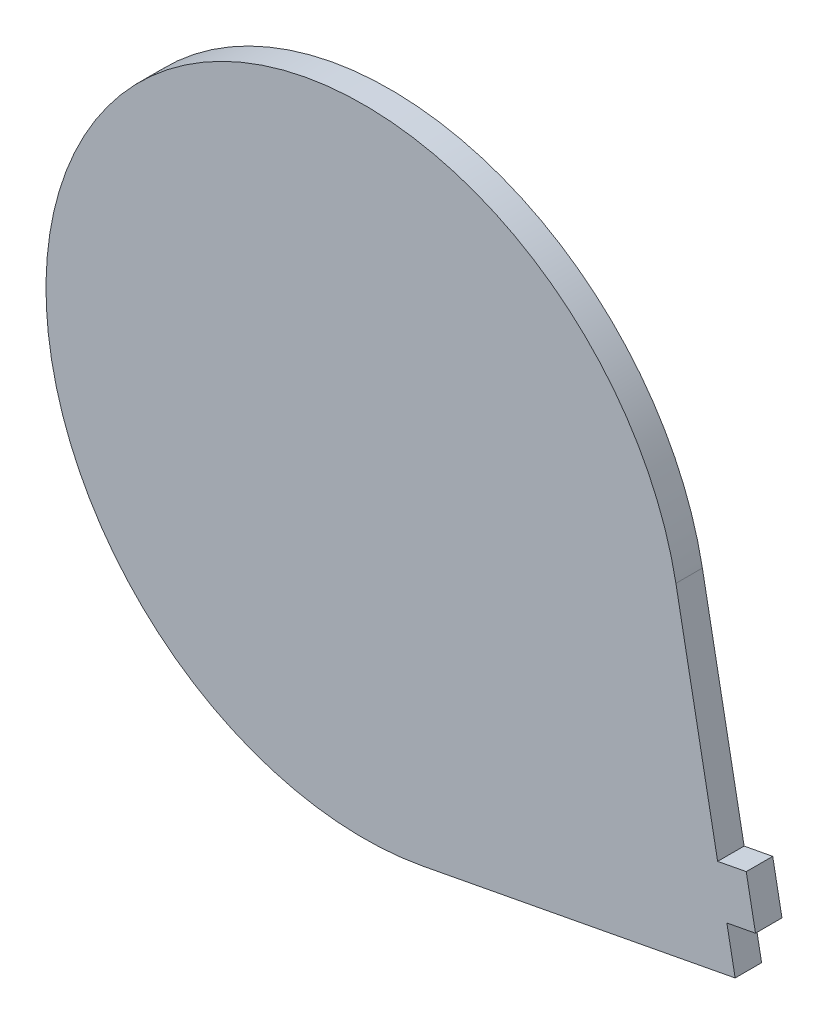
ISO-10303-21;
HEADER;
FILE_DESCRIPTION(('STEP AP214'),'2;1');
FILE_NAME('part.step','',(''),(''),'','','');
FILE_SCHEMA(('AUTOMOTIVE_DESIGN { 1 0 10303 214 1 1 1 1 }'));
ENDSEC;
DATA;
#1=APPLICATION_CONTEXT('core data for automotive mechanical design processes');
#2=APPLICATION_PROTOCOL_DEFINITION('international standard','automotive_design',2000,#1);
#3=PRODUCT_CONTEXT('',#1,'mechanical');
#4=PRODUCT('Part','Part','',(#3));
#5=PRODUCT_RELATED_PRODUCT_CATEGORY('part','',(#4));
#6=PRODUCT_DEFINITION_FORMATION('','',#4);
#7=PRODUCT_DEFINITION_CONTEXT('part definition',#1,'design');
#8=PRODUCT_DEFINITION('design','',#6,#7);
#9=PRODUCT_DEFINITION_SHAPE('','',#8);
#10=(LENGTH_UNIT() NAMED_UNIT(*) SI_UNIT(.MILLI.,.METRE.));
#11=(NAMED_UNIT(*) PLANE_ANGLE_UNIT() SI_UNIT($,.RADIAN.));
#12=(NAMED_UNIT(*) SI_UNIT($,.STERADIAN.) SOLID_ANGLE_UNIT());
#13=UNCERTAINTY_MEASURE_WITH_UNIT(LENGTH_MEASURE(1.E-05),#10,'distance_accuracy_value','');
#14=(GEOMETRIC_REPRESENTATION_CONTEXT(3) GLOBAL_UNCERTAINTY_ASSIGNED_CONTEXT((#13)) GLOBAL_UNIT_ASSIGNED_CONTEXT((#10,
#11,#12)) REPRESENTATION_CONTEXT('',''));
#15=CARTESIAN_POINT('',(0.,0.,0.));
#16=DIRECTION('',(0.,0.,1.));
#17=DIRECTION('',(1.,0.,0.));
#18=AXIS2_PLACEMENT_3D('',#15,#16,#17);
#19=CARTESIAN_POINT('',(73.9776567042315,-38.5157686824239,5.));
#20=DIRECTION('',(-0.186433879772931,0.98246751013599,0.));
#21=DIRECTION('',(-0.98246751013599,-0.186433879772931,0.));
#22=AXIS2_PLACEMENT_3D('',#19,#20,#21);
#23=PLANE('',#22);
#24=DIRECTION('',(0.98246751013599,0.186433879772931,0.));
#25=VECTOR('',#24,1.);
#26=CARTESIAN_POINT('',(73.9776567042315,-38.5157686824239,0.));
#27=LINE('',#26,#25);
#28=CARTESIAN_POINT('',(68.5740853984835,-39.5411550211751,0.));
#29=VERTEX_POINT('',#28);
#30=CARTESIAN_POINT('',(73.9776567042315,-38.5157686824239,0.));
#31=VERTEX_POINT('',#30);
#32=EDGE_CURVE('E123',#29,#31,#27,.T.);
#33=ORIENTED_EDGE('',*,*,#32,.T.);
#34=DIRECTION('',(0.,0.,-1.));
#35=VECTOR('',#34,1.);
#36=CARTESIAN_POINT('',(73.9776567042315,-38.5157686824239,5.));
#37=LINE('',#36,#35);
#38=CARTESIAN_POINT('',(73.9776567042315,-38.5157686824239,5.));
#39=VERTEX_POINT('',#38);
#40=EDGE_CURVE('E11',#39,#31,#37,.T.);
#41=ORIENTED_EDGE('',*,*,#40,.F.);
#42=DIRECTION('',(0.98246751013599,0.186433879772931,0.));
#43=VECTOR('',#42,1.);
#44=CARTESIAN_POINT('',(73.9776567042315,-38.5157686824239,5.));
#45=LINE('',#44,#43);
#46=CARTESIAN_POINT('',(68.5740853984835,-39.5411550211751,5.));
#47=VERTEX_POINT('',#46);
#48=EDGE_CURVE('E135',#47,#39,#45,.T.);
#49=ORIENTED_EDGE('',*,*,#48,.F.);
#50=DIRECTION('',(0.,0.,-1.));
#51=VECTOR('',#50,1.);
#52=CARTESIAN_POINT('',(68.5740853984835,-39.5411550211751,5.));
#53=LINE('',#52,#51);
#54=EDGE_CURVE('E119',#47,#29,#53,.T.);
#55=ORIENTED_EDGE('',*,*,#54,.T.);
#56=EDGE_LOOP('',(#33,#41,#49,#55));
#57=FACE_BOUND('',#56,.T.);
#58=ADVANCED_FACE('F33',(#57),#23,.F.);
#59=CARTESIAN_POINT('',(73.9776567042315,-38.5157686824239,5.));
#60=DIRECTION('',(-0.982467510135989,-0.186433879772938,0.));
#61=DIRECTION('',(0.186433879772938,-0.982467510135989,0.));
#62=AXIS2_PLACEMENT_3D('',#59,#60,#61);
#63=PLANE('',#62);
#64=DIRECTION('',(-0.186433879772938,0.982467510135989,0.));
#65=VECTOR('',#64,1.);
#66=CARTESIAN_POINT('',(73.9776567042315,-38.5157686824239,0.));
#67=LINE('',#66,#65);
#68=CARTESIAN_POINT('',(72.231899428722,-29.315993374092,0.));
#69=VERTEX_POINT('',#68);
#70=EDGE_CURVE('E126',#31,#69,#67,.T.);
#71=ORIENTED_EDGE('',*,*,#70,.T.);
#72=DIRECTION('',(0.,0.,-1.));
#73=VECTOR('',#72,1.);
#74=CARTESIAN_POINT('',(72.231899428722,-29.315993374092,5.));
#75=LINE('',#74,#73);
#76=CARTESIAN_POINT('',(72.231899428722,-29.315993374092,5.));
#77=VERTEX_POINT('',#76);
#78=EDGE_CURVE('E41',#77,#69,#75,.T.);
#79=ORIENTED_EDGE('',*,*,#78,.F.);
#80=DIRECTION('',(-0.186433879772938,0.982467510135989,0.));
#81=VECTOR('',#80,1.);
#82=CARTESIAN_POINT('',(73.9776567042315,-38.5157686824239,5.));
#83=LINE('',#82,#81);
#84=EDGE_CURVE('E89',#39,#77,#83,.T.);
#85=ORIENTED_EDGE('',*,*,#84,.F.);
#86=ORIENTED_EDGE('',*,*,#40,.T.);
#87=EDGE_LOOP('',(#71,#79,#85,#86));
#88=FACE_BOUND('',#87,.T.);
#89=ADVANCED_FACE('F160',(#88),#63,.F.);
#90=CARTESIAN_POINT('',(66.828328122974,-30.3413797128432,5.));
#91=DIRECTION('',(0.186433879772939,-0.982467510135989,0.));
#92=DIRECTION('',(0.982467510135989,0.186433879772939,0.));
#93=AXIS2_PLACEMENT_3D('',#90,#91,#92);
#94=PLANE('',#93);
#95=DIRECTION('',(-0.982467510135989,-0.186433879772939,0.));
#96=VECTOR('',#95,1.);
#97=CARTESIAN_POINT('',(66.828328122974,-30.3413797128432,0.));
#98=LINE('',#97,#96);
#99=CARTESIAN_POINT('',(66.828328122974,-30.3413797128432,0.));
#100=VERTEX_POINT('',#99);
#101=EDGE_CURVE('E128',#69,#100,#98,.T.);
#102=ORIENTED_EDGE('',*,*,#101,.T.);
#103=DIRECTION('',(0.,0.,-1.));
#104=VECTOR('',#103,1.);
#105=CARTESIAN_POINT('',(66.828328122974,-30.3413797128432,5.));
#106=LINE('',#105,#104);
#107=CARTESIAN_POINT('',(66.828328122974,-30.3413797128432,5.));
#108=VERTEX_POINT('',#107);
#109=EDGE_CURVE('E139',#108,#100,#106,.T.);
#110=ORIENTED_EDGE('',*,*,#109,.F.);
#111=DIRECTION('',(-0.982467510135989,-0.186433879772939,0.));
#112=VECTOR('',#111,1.);
#113=CARTESIAN_POINT('',(66.828328122974,-30.3413797128432,5.));
#114=LINE('',#113,#112);
#115=EDGE_CURVE('E147',#77,#108,#114,.T.);
#116=ORIENTED_EDGE('',*,*,#115,.F.);
#117=ORIENTED_EDGE('',*,*,#78,.T.);
#118=EDGE_LOOP('',(#102,#110,#116,#117));
#119=FACE_BOUND('',#118,.T.);
#120=ADVANCED_FACE('F145',(#119),#94,.F.);
#121=CARTESIAN_POINT('',(58.9480506081592,11.1860327863763,5.));
#122=DIRECTION('',(-0.982467510135989,-0.186433879772939,0.));
#123=DIRECTION('',(0.186433879772939,-0.982467510135989,0.));
#124=AXIS2_PLACEMENT_3D('',#121,#122,#123);
#125=PLANE('',#124);
#126=DIRECTION('',(-0.186433879772939,0.982467510135989,0.));
#127=VECTOR('',#126,1.);
#128=CARTESIAN_POINT('',(58.9480506081592,11.1860327863763,0.));
#129=LINE('',#128,#127);
#130=CARTESIAN_POINT('',(58.9480506081592,11.1860327863763,0.));
#131=VERTEX_POINT('',#130);
#132=EDGE_CURVE('E130',#100,#131,#129,.T.);
#133=ORIENTED_EDGE('',*,*,#132,.T.);
#134=DIRECTION('',(0.,0.,-1.));
#135=VECTOR('',#134,1.);
#136=CARTESIAN_POINT('',(58.9480506081592,11.1860327863763,5.));
#137=LINE('',#136,#135);
#138=CARTESIAN_POINT('',(58.9480506081592,11.1860327863763,5.));
#139=VERTEX_POINT('',#138);
#140=EDGE_CURVE('E114',#139,#131,#137,.T.);
#141=ORIENTED_EDGE('',*,*,#140,.F.);
#142=DIRECTION('',(-0.186433879772939,0.982467510135989,0.));
#143=VECTOR('',#142,1.);
#144=CARTESIAN_POINT('',(58.9480506081592,11.1860327863763,5.));
#145=LINE('',#144,#143);
#146=EDGE_CURVE('E105',#108,#139,#145,.T.);
#147=ORIENTED_EDGE('',*,*,#146,.F.);
#148=ORIENTED_EDGE('',*,*,#109,.T.);
#149=EDGE_LOOP('',(#133,#141,#147,#148));
#150=FACE_BOUND('',#149,.T.);
#151=ADVANCED_FACE('F153',(#150),#125,.F.);
#152=CARTESIAN_POINT('',(0.,0.,5.));
#153=DIRECTION('',(0.,0.,-1.));
#154=DIRECTION('',(-1.,0.,0.));
#155=AXIS2_PLACEMENT_3D('',#152,#153,#154);
#156=CYLINDRICAL_SURFACE('',#155,60.);
#157=CARTESIAN_POINT('',(0.,0.,0.));
#158=DIRECTION('',(0.,0.,1.));
#159=DIRECTION('',(1.,0.,0.));
#160=AXIS2_PLACEMENT_3D('',#157,#158,#159);
#161=CIRCLE('',#160,60.);
#162=CARTESIAN_POINT('',(11.1860327863762,-58.9480506081593,0.));
#163=VERTEX_POINT('',#162);
#164=EDGE_CURVE('E113',#131,#163,#161,.T.);
#165=ORIENTED_EDGE('',*,*,#164,.T.);
#166=DIRECTION('',(0.,0.,-1.));
#167=VECTOR('',#166,1.);
#168=CARTESIAN_POINT('',(11.1860327863762,-58.9480506081593,5.));
#169=LINE('',#168,#167);
#170=CARTESIAN_POINT('',(11.1860327863762,-58.9480506081593,5.));
#171=VERTEX_POINT('',#170);
#172=EDGE_CURVE('E110',#171,#163,#169,.T.);
#173=ORIENTED_EDGE('',*,*,#172,.F.);
#174=CARTESIAN_POINT('',(0.,0.,5.));
#175=DIRECTION('',(0.,0.,1.));
#176=DIRECTION('',(1.,0.,0.));
#177=AXIS2_PLACEMENT_3D('',#174,#175,#176);
#178=CIRCLE('',#177,60.);
#179=EDGE_CURVE('E99',#139,#171,#178,.T.);
#180=ORIENTED_EDGE('',*,*,#179,.F.);
#181=ORIENTED_EDGE('',*,*,#140,.T.);
#182=EDGE_LOOP('',(#165,#173,#180,#181));
#183=FACE_BOUND('',#182,.T.);
#184=ADVANCED_FACE('F111',(#183),#156,.T.);
#185=CARTESIAN_POINT('',(70.1340833945355,-47.762017821783,5.));
#186=DIRECTION('',(-0.186433879772941,0.982467510135989,0.));
#187=DIRECTION('',(-0.982467510135989,-0.186433879772941,0.));
#188=AXIS2_PLACEMENT_3D('',#185,#186,#187);
#189=PLANE('',#188);
#190=DIRECTION('',(0.982467510135988,0.186433879772941,0.));
#191=VECTOR('',#190,1.);
#192=CARTESIAN_POINT('',(70.1340833945355,-47.762017821783,0.));
#193=LINE('',#192,#191);
#194=CARTESIAN_POINT('',(70.1340833945355,-47.762017821783,0.));
#195=VERTEX_POINT('',#194);
#196=EDGE_CURVE('E75',#163,#195,#193,.T.);
#197=ORIENTED_EDGE('',*,*,#196,.T.);
#198=DIRECTION('',(0.,0.,-1.));
#199=VECTOR('',#198,1.);
#200=CARTESIAN_POINT('',(70.1340833945355,-47.762017821783,5.));
#201=LINE('',#200,#199);
#202=CARTESIAN_POINT('',(70.1340833945355,-47.762017821783,5.));
#203=VERTEX_POINT('',#202);
#204=EDGE_CURVE('E115',#203,#195,#201,.T.);
#205=ORIENTED_EDGE('',*,*,#204,.F.);
#206=DIRECTION('',(0.982467510135988,0.186433879772941,0.));
#207=VECTOR('',#206,1.);
#208=CARTESIAN_POINT('',(70.1340833945355,-47.762017821783,5.));
#209=LINE('',#208,#207);
#210=EDGE_CURVE('E103',#171,#203,#209,.T.);
#211=ORIENTED_EDGE('',*,*,#210,.F.);
#212=ORIENTED_EDGE('',*,*,#172,.T.);
#213=EDGE_LOOP('',(#197,#205,#211,#212));
#214=FACE_BOUND('',#213,.T.);
#215=ADVANCED_FACE('F117',(#214),#189,.F.);
#216=CARTESIAN_POINT('',(68.5740853984835,-39.5411550211751,5.));
#217=DIRECTION('',(-0.982467510135989,-0.186433879772938,0.));
#218=DIRECTION('',(0.186433879772938,-0.982467510135989,0.));
#219=AXIS2_PLACEMENT_3D('',#216,#217,#218);
#220=PLANE('',#219);
#221=DIRECTION('',(-0.186433879772938,0.982467510135989,0.));
#222=VECTOR('',#221,1.);
#223=CARTESIAN_POINT('',(68.5740853984835,-39.5411550211751,0.));
#224=LINE('',#223,#222);
#225=EDGE_CURVE('E81',#195,#29,#224,.T.);
#226=ORIENTED_EDGE('',*,*,#225,.T.);
#227=ORIENTED_EDGE('',*,*,#54,.F.);
#228=DIRECTION('',(-0.186433879772938,0.982467510135989,0.));
#229=VECTOR('',#228,1.);
#230=CARTESIAN_POINT('',(68.5740853984835,-39.5411550211751,5.));
#231=LINE('',#230,#229);
#232=EDGE_CURVE('E49',#203,#47,#231,.T.);
#233=ORIENTED_EDGE('',*,*,#232,.F.);
#234=ORIENTED_EDGE('',*,*,#204,.T.);
#235=EDGE_LOOP('',(#226,#227,#233,#234));
#236=FACE_BOUND('',#235,.T.);
#237=ADVANCED_FACE('F174',(#236),#220,.F.);
#238=CARTESIAN_POINT('',(0.,0.,5.));
#239=DIRECTION('',(0.,0.,1.));
#240=DIRECTION('',(1.,0.,0.));
#241=AXIS2_PLACEMENT_3D('',#238,#239,#240);
#242=PLANE('',#241);
#243=ORIENTED_EDGE('',*,*,#48,.T.);
#244=ORIENTED_EDGE('',*,*,#84,.T.);
#245=ORIENTED_EDGE('',*,*,#115,.T.);
#246=ORIENTED_EDGE('',*,*,#146,.T.);
#247=ORIENTED_EDGE('',*,*,#179,.T.);
#248=ORIENTED_EDGE('',*,*,#210,.T.);
#249=ORIENTED_EDGE('',*,*,#232,.T.);
#250=EDGE_LOOP('',(#243,#244,#245,#246,#247,#248,#249));
#251=FACE_BOUND('',#250,.T.);
#252=ADVANCED_FACE('F101',(#251),#242,.T.);
#253=CARTESIAN_POINT('',(0.,0.,0.));
#254=DIRECTION('',(0.,0.,1.));
#255=DIRECTION('',(1.,0.,0.));
#256=AXIS2_PLACEMENT_3D('',#253,#254,#255);
#257=PLANE('',#256);
#258=ORIENTED_EDGE('',*,*,#32,.F.);
#259=ORIENTED_EDGE('',*,*,#225,.F.);
#260=ORIENTED_EDGE('',*,*,#196,.F.);
#261=ORIENTED_EDGE('',*,*,#164,.F.);
#262=ORIENTED_EDGE('',*,*,#132,.F.);
#263=ORIENTED_EDGE('',*,*,#101,.F.);
#264=ORIENTED_EDGE('',*,*,#70,.F.);
#265=EDGE_LOOP('',(#258,#259,#260,#261,#262,#263,#264));
#266=FACE_BOUND('',#265,.T.);
#267=ADVANCED_FACE('F151',(#266),#257,.F.);
#268=CLOSED_SHELL('',(#58,#89,#120,#151,#184,#215,#237,#252,#267));
#269=MANIFOLD_SOLID_BREP('B2',#268);
#270=ADVANCED_BREP_SHAPE_REPRESENTATION('',(#18,#269),#14);
#271=SHAPE_DEFINITION_REPRESENTATION(#9,#270);
ENDSEC;
END-ISO-10303-21;
